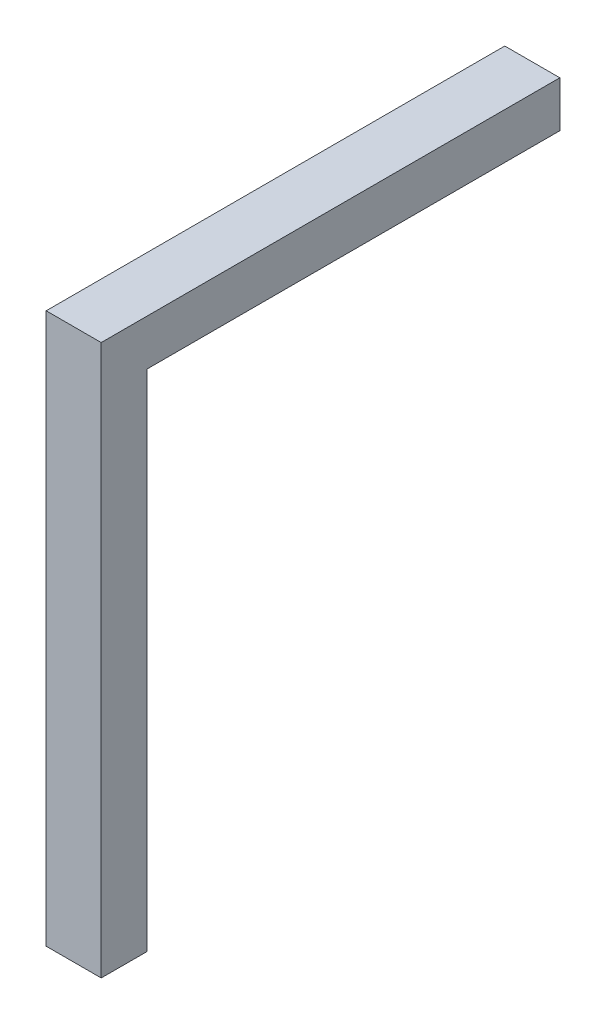
ISO-10303-21;
HEADER;
FILE_DESCRIPTION(('STEP AP214'),'2;1');
FILE_NAME('part.step','',(''),(''),'','','');
FILE_SCHEMA(('AUTOMOTIVE_DESIGN { 1 0 10303 214 1 1 1 1 }'));
ENDSEC;
DATA;
#1=APPLICATION_CONTEXT('core data for automotive mechanical design processes');
#2=APPLICATION_PROTOCOL_DEFINITION('international standard','automotive_design',2000,#1);
#3=PRODUCT_CONTEXT('',#1,'mechanical');
#4=PRODUCT('Part','Part','',(#3));
#5=PRODUCT_RELATED_PRODUCT_CATEGORY('part','',(#4));
#6=PRODUCT_DEFINITION_FORMATION('','',#4);
#7=PRODUCT_DEFINITION_CONTEXT('part definition',#1,'design');
#8=PRODUCT_DEFINITION('design','',#6,#7);
#9=PRODUCT_DEFINITION_SHAPE('','',#8);
#10=(LENGTH_UNIT() NAMED_UNIT(*) SI_UNIT(.MILLI.,.METRE.));
#11=(NAMED_UNIT(*) PLANE_ANGLE_UNIT() SI_UNIT($,.RADIAN.));
#12=(NAMED_UNIT(*) SI_UNIT($,.STERADIAN.) SOLID_ANGLE_UNIT());
#13=UNCERTAINTY_MEASURE_WITH_UNIT(LENGTH_MEASURE(1.E-05),#10,'distance_accuracy_value','');
#14=(GEOMETRIC_REPRESENTATION_CONTEXT(3) GLOBAL_UNCERTAINTY_ASSIGNED_CONTEXT((#13)) GLOBAL_UNIT_ASSIGNED_CONTEXT((#10,
#11,#12)) REPRESENTATION_CONTEXT('',''));
#15=CARTESIAN_POINT('',(0.,0.,0.));
#16=DIRECTION('',(0.,0.,1.));
#17=DIRECTION('',(1.,0.,0.));
#18=AXIS2_PLACEMENT_3D('',#15,#16,#17);
#19=CARTESIAN_POINT('',(6.,31.4321608040201,10.));
#20=DIRECTION('',(0.,0.,1.));
#21=DIRECTION('',(1.,0.,0.));
#22=AXIS2_PLACEMENT_3D('',#19,#20,#21);
#23=PLANE('',#22);
#24=DIRECTION('',(0.,1.,0.));
#25=VECTOR('',#24,1.);
#26=CARTESIAN_POINT('',(0.,31.4321608040201,10.));
#27=LINE('',#26,#25);
#28=CARTESIAN_POINT('',(0.,31.4321608040201,10.));
#29=VERTEX_POINT('',#28);
#30=CARTESIAN_POINT('',(0.,36.4321608040201,10.));
#31=VERTEX_POINT('',#30);
#32=EDGE_CURVE('E118',#29,#31,#27,.T.);
#33=ORIENTED_EDGE('',*,*,#32,.T.);
#34=DIRECTION('',(-1.,0.,0.));
#35=VECTOR('',#34,1.);
#36=CARTESIAN_POINT('',(6.,36.4321608040201,10.));
#37=LINE('',#36,#35);
#38=CARTESIAN_POINT('',(6.,36.4321608040201,10.));
#39=VERTEX_POINT('',#38);
#40=EDGE_CURVE('E11',#39,#31,#37,.T.);
#41=ORIENTED_EDGE('',*,*,#40,.F.);
#42=DIRECTION('',(0.,1.,0.));
#43=VECTOR('',#42,1.);
#44=CARTESIAN_POINT('',(6.,31.4321608040201,10.));
#45=LINE('',#44,#43);
#46=CARTESIAN_POINT('',(6.,31.4321608040201,10.));
#47=VERTEX_POINT('',#46);
#48=EDGE_CURVE('E128',#47,#39,#45,.T.);
#49=ORIENTED_EDGE('',*,*,#48,.F.);
#50=DIRECTION('',(-1.,0.,0.));
#51=VECTOR('',#50,1.);
#52=CARTESIAN_POINT('',(6.,31.4321608040201,10.));
#53=LINE('',#52,#51);
#54=EDGE_CURVE('E114',#47,#29,#53,.T.);
#55=ORIENTED_EDGE('',*,*,#54,.T.);
#56=EDGE_LOOP('',(#33,#41,#49,#55));
#57=FACE_BOUND('',#56,.T.);
#58=ADVANCED_FACE('F34',(#57),#23,.F.);
#59=CARTESIAN_POINT('',(6.,36.4321608040201,10.));
#60=DIRECTION('',(0.,-1.,0.));
#61=DIRECTION('',(0.,0.,-1.));
#62=AXIS2_PLACEMENT_3D('',#59,#60,#61);
#63=PLANE('',#62);
#64=DIRECTION('',(0.,0.,1.));
#65=VECTOR('',#64,1.);
#66=CARTESIAN_POINT('',(0.,36.4321608040201,10.));
#67=LINE('',#66,#65);
#68=CARTESIAN_POINT('',(0.,36.4321608040201,60.));
#69=VERTEX_POINT('',#68);
#70=EDGE_CURVE('E121',#31,#69,#67,.T.);
#71=ORIENTED_EDGE('',*,*,#70,.T.);
#72=DIRECTION('',(-1.,0.,0.));
#73=VECTOR('',#72,1.);
#74=CARTESIAN_POINT('',(6.,36.4321608040201,60.));
#75=LINE('',#74,#73);
#76=CARTESIAN_POINT('',(6.,36.4321608040201,60.));
#77=VERTEX_POINT('',#76);
#78=EDGE_CURVE('E42',#77,#69,#75,.T.);
#79=ORIENTED_EDGE('',*,*,#78,.F.);
#80=DIRECTION('',(0.,0.,1.));
#81=VECTOR('',#80,1.);
#82=CARTESIAN_POINT('',(6.,36.4321608040201,10.));
#83=LINE('',#82,#81);
#84=EDGE_CURVE('E87',#39,#77,#83,.T.);
#85=ORIENTED_EDGE('',*,*,#84,.F.);
#86=ORIENTED_EDGE('',*,*,#40,.T.);
#87=EDGE_LOOP('',(#71,#79,#85,#86));
#88=FACE_BOUND('',#87,.T.);
#89=ADVANCED_FACE('F152',(#88),#63,.F.);
#90=CARTESIAN_POINT('',(6.,36.4321608040201,60.));
#91=DIRECTION('',(0.,0.,-1.));
#92=DIRECTION('',(0.,1.,0.));
#93=AXIS2_PLACEMENT_3D('',#90,#91,#92);
#94=PLANE('',#93);
#95=DIRECTION('',(0.,-1.,0.));
#96=VECTOR('',#95,1.);
#97=CARTESIAN_POINT('',(0.,36.4321608040201,60.));
#98=LINE('',#97,#96);
#99=CARTESIAN_POINT('',(0.,-23.5678391959799,60.));
#100=VERTEX_POINT('',#99);
#101=EDGE_CURVE('E123',#69,#100,#98,.T.);
#102=ORIENTED_EDGE('',*,*,#101,.T.);
#103=DIRECTION('',(-1.,0.,0.));
#104=VECTOR('',#103,1.);
#105=CARTESIAN_POINT('',(6.,-23.5678391959799,60.));
#106=LINE('',#105,#104);
#107=CARTESIAN_POINT('',(6.,-23.5678391959799,60.));
#108=VERTEX_POINT('',#107);
#109=EDGE_CURVE('E109',#108,#100,#106,.T.);
#110=ORIENTED_EDGE('',*,*,#109,.F.);
#111=DIRECTION('',(0.,-1.,0.));
#112=VECTOR('',#111,1.);
#113=CARTESIAN_POINT('',(6.,36.4321608040201,60.));
#114=LINE('',#113,#112);
#115=EDGE_CURVE('E100',#77,#108,#114,.T.);
#116=ORIENTED_EDGE('',*,*,#115,.F.);
#117=ORIENTED_EDGE('',*,*,#78,.T.);
#118=EDGE_LOOP('',(#102,#110,#116,#117));
#119=FACE_BOUND('',#118,.T.);
#120=ADVANCED_FACE('F134',(#119),#94,.F.);
#121=CARTESIAN_POINT('',(6.,-23.5678391959799,60.));
#122=DIRECTION('',(0.,1.,0.));
#123=DIRECTION('',(0.,0.,1.));
#124=AXIS2_PLACEMENT_3D('',#121,#122,#123);
#125=PLANE('',#124);
#126=DIRECTION('',(0.,0.,-1.));
#127=VECTOR('',#126,1.);
#128=CARTESIAN_POINT('',(0.,-23.5678391959799,60.));
#129=LINE('',#128,#127);
#130=CARTESIAN_POINT('',(0.,-23.5678391959799,55.));
#131=VERTEX_POINT('',#130);
#132=EDGE_CURVE('E108',#100,#131,#129,.T.);
#133=ORIENTED_EDGE('',*,*,#132,.T.);
#134=DIRECTION('',(-1.,0.,0.));
#135=VECTOR('',#134,1.);
#136=CARTESIAN_POINT('',(6.,-23.5678391959799,55.));
#137=LINE('',#136,#135);
#138=CARTESIAN_POINT('',(6.,-23.5678391959799,55.));
#139=VERTEX_POINT('',#138);
#140=EDGE_CURVE('E105',#139,#131,#137,.T.);
#141=ORIENTED_EDGE('',*,*,#140,.F.);
#142=DIRECTION('',(0.,0.,-1.));
#143=VECTOR('',#142,1.);
#144=CARTESIAN_POINT('',(6.,-23.5678391959799,60.));
#145=LINE('',#144,#143);
#146=EDGE_CURVE('E94',#108,#139,#145,.T.);
#147=ORIENTED_EDGE('',*,*,#146,.F.);
#148=ORIENTED_EDGE('',*,*,#109,.T.);
#149=EDGE_LOOP('',(#133,#141,#147,#148));
#150=FACE_BOUND('',#149,.T.);
#151=ADVANCED_FACE('F106',(#150),#125,.F.);
#152=CARTESIAN_POINT('',(6.,-23.5678391959799,55.));
#153=DIRECTION('',(0.,0.,1.));
#154=DIRECTION('',(1.,0.,0.));
#155=AXIS2_PLACEMENT_3D('',#152,#153,#154);
#156=PLANE('',#155);
#157=DIRECTION('',(0.,1.,0.));
#158=VECTOR('',#157,1.);
#159=CARTESIAN_POINT('',(0.,-23.5678391959799,55.));
#160=LINE('',#159,#158);
#161=CARTESIAN_POINT('',(0.,31.4321608040201,55.));
#162=VERTEX_POINT('',#161);
#163=EDGE_CURVE('E73',#131,#162,#160,.T.);
#164=ORIENTED_EDGE('',*,*,#163,.T.);
#165=DIRECTION('',(-1.,0.,0.));
#166=VECTOR('',#165,1.);
#167=CARTESIAN_POINT('',(6.,31.4321608040201,55.));
#168=LINE('',#167,#166);
#169=CARTESIAN_POINT('',(6.,31.4321608040201,55.));
#170=VERTEX_POINT('',#169);
#171=EDGE_CURVE('E110',#170,#162,#168,.T.);
#172=ORIENTED_EDGE('',*,*,#171,.F.);
#173=DIRECTION('',(0.,1.,0.));
#174=VECTOR('',#173,1.);
#175=CARTESIAN_POINT('',(6.,-23.5678391959799,55.));
#176=LINE('',#175,#174);
#177=EDGE_CURVE('E98',#139,#170,#176,.T.);
#178=ORIENTED_EDGE('',*,*,#177,.F.);
#179=ORIENTED_EDGE('',*,*,#140,.T.);
#180=EDGE_LOOP('',(#164,#172,#178,#179));
#181=FACE_BOUND('',#180,.T.);
#182=ADVANCED_FACE('F112',(#181),#156,.F.);
#183=CARTESIAN_POINT('',(6.,31.4321608040201,55.));
#184=DIRECTION('',(0.,1.,0.));
#185=DIRECTION('',(0.,0.,1.));
#186=AXIS2_PLACEMENT_3D('',#183,#184,#185);
#187=PLANE('',#186);
#188=DIRECTION('',(0.,0.,-1.));
#189=VECTOR('',#188,1.);
#190=CARTESIAN_POINT('',(0.,31.4321608040201,55.));
#191=LINE('',#190,#189);
#192=EDGE_CURVE('E79',#162,#29,#191,.T.);
#193=ORIENTED_EDGE('',*,*,#192,.T.);
#194=ORIENTED_EDGE('',*,*,#54,.F.);
#195=DIRECTION('',(0.,0.,-1.));
#196=VECTOR('',#195,1.);
#197=CARTESIAN_POINT('',(6.,31.4321608040201,55.));
#198=LINE('',#197,#196);
#199=EDGE_CURVE('E50',#170,#47,#198,.T.);
#200=ORIENTED_EDGE('',*,*,#199,.F.);
#201=ORIENTED_EDGE('',*,*,#171,.T.);
#202=EDGE_LOOP('',(#193,#194,#200,#201));
#203=FACE_BOUND('',#202,.T.);
#204=ADVANCED_FACE('F141',(#203),#187,.F.);
#205=CARTESIAN_POINT('',(6.,0.,0.));
#206=DIRECTION('',(1.,0.,0.));
#207=DIRECTION('',(0.,0.,-1.));
#208=AXIS2_PLACEMENT_3D('',#205,#206,#207);
#209=PLANE('',#208);
#210=ORIENTED_EDGE('',*,*,#48,.T.);
#211=ORIENTED_EDGE('',*,*,#84,.T.);
#212=ORIENTED_EDGE('',*,*,#115,.T.);
#213=ORIENTED_EDGE('',*,*,#146,.T.);
#214=ORIENTED_EDGE('',*,*,#177,.T.);
#215=ORIENTED_EDGE('',*,*,#199,.T.);
#216=EDGE_LOOP('',(#210,#211,#212,#213,#214,#215));
#217=FACE_BOUND('',#216,.T.);
#218=ADVANCED_FACE('F96',(#217),#209,.T.);
#219=CARTESIAN_POINT('',(0.,0.,0.));
#220=DIRECTION('',(1.,0.,0.));
#221=DIRECTION('',(0.,0.,-1.));
#222=AXIS2_PLACEMENT_3D('',#219,#220,#221);
#223=PLANE('',#222);
#224=ORIENTED_EDGE('',*,*,#32,.F.);
#225=ORIENTED_EDGE('',*,*,#192,.F.);
#226=ORIENTED_EDGE('',*,*,#163,.F.);
#227=ORIENTED_EDGE('',*,*,#132,.F.);
#228=ORIENTED_EDGE('',*,*,#101,.F.);
#229=ORIENTED_EDGE('',*,*,#70,.F.);
#230=EDGE_LOOP('',(#224,#225,#226,#227,#228,#229));
#231=FACE_BOUND('',#230,.T.);
#232=ADVANCED_FACE('F137',(#231),#223,.F.);
#233=CLOSED_SHELL('',(#58,#89,#120,#151,#182,#204,#218,#232));
#234=MANIFOLD_SOLID_BREP('B2',#233);
#235=ADVANCED_BREP_SHAPE_REPRESENTATION('',(#18,#234),#14);
#236=SHAPE_DEFINITION_REPRESENTATION(#9,#235);
ENDSEC;
END-ISO-10303-21;
